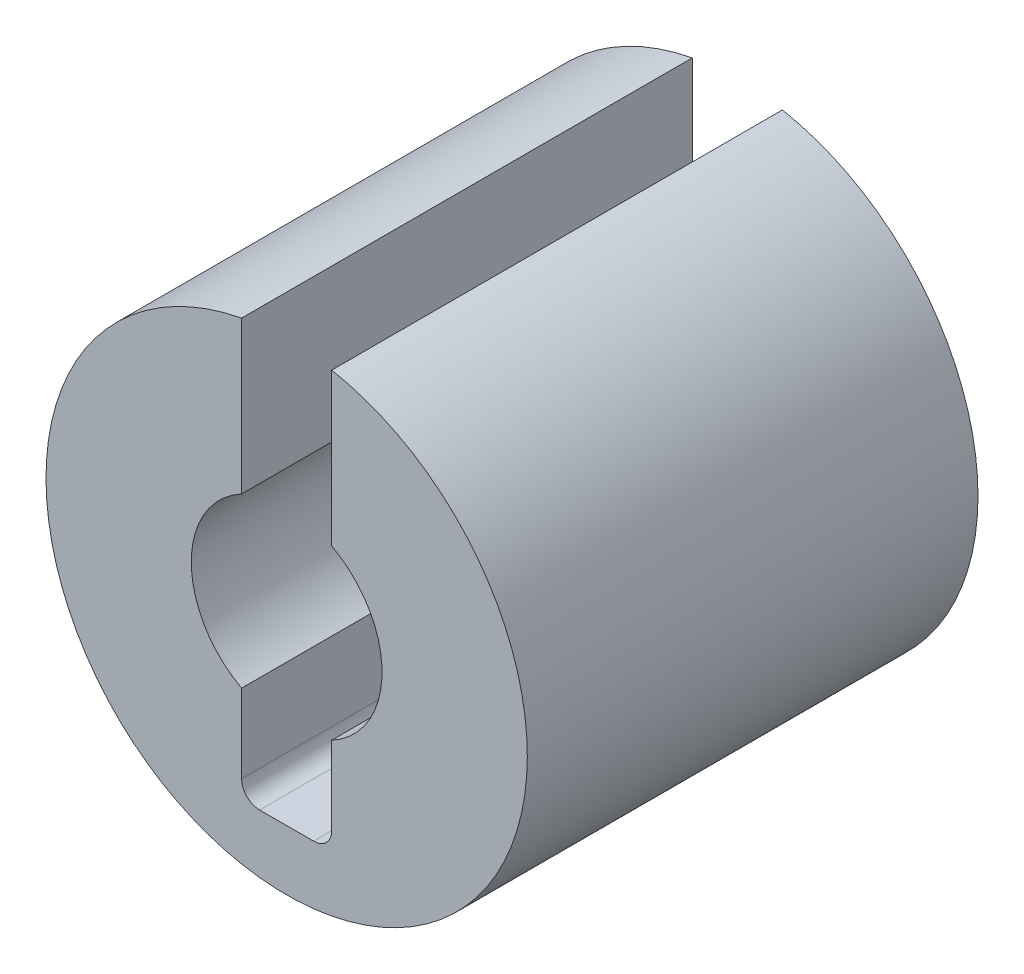
ISO-10303-21;
HEADER;
FILE_DESCRIPTION(('STEP AP214'),'2;1');
FILE_NAME('part.step','',(''),(''),'','','');
FILE_SCHEMA(('AUTOMOTIVE_DESIGN { 1 0 10303 214 1 1 1 1 }'));
ENDSEC;
DATA;
#1=APPLICATION_CONTEXT('core data for automotive mechanical design processes');
#2=APPLICATION_PROTOCOL_DEFINITION('international standard','automotive_design',2000,#1);
#3=PRODUCT_CONTEXT('',#1,'mechanical');
#4=PRODUCT('Part','Part','',(#3));
#5=PRODUCT_RELATED_PRODUCT_CATEGORY('part','',(#4));
#6=PRODUCT_DEFINITION_FORMATION('','',#4);
#7=PRODUCT_DEFINITION_CONTEXT('part definition',#1,'design');
#8=PRODUCT_DEFINITION('design','',#6,#7);
#9=PRODUCT_DEFINITION_SHAPE('','',#8);
#10=(LENGTH_UNIT() NAMED_UNIT(*) SI_UNIT(.MILLI.,.METRE.));
#11=(NAMED_UNIT(*) PLANE_ANGLE_UNIT() SI_UNIT($,.RADIAN.));
#12=(NAMED_UNIT(*) SI_UNIT($,.STERADIAN.) SOLID_ANGLE_UNIT());
#13=UNCERTAINTY_MEASURE_WITH_UNIT(LENGTH_MEASURE(1.E-05),#10,'distance_accuracy_value','');
#14=(GEOMETRIC_REPRESENTATION_CONTEXT(3) GLOBAL_UNCERTAINTY_ASSIGNED_CONTEXT((#13)) GLOBAL_UNIT_ASSIGNED_CONTEXT((#10,
#11,#12)) REPRESENTATION_CONTEXT('',''));
#15=CARTESIAN_POINT('',(0.,0.,0.));
#16=DIRECTION('',(0.,0.,1.));
#17=DIRECTION('',(1.,0.,0.));
#18=AXIS2_PLACEMENT_3D('',#15,#16,#17);
#19=CARTESIAN_POINT('',(-0.75,-3.005,7.5));
#20=DIRECTION('',(0.,-1.,0.));
#21=DIRECTION('',(0.,0.,-1.));
#22=AXIS2_PLACEMENT_3D('',#19,#20,#21);
#23=PLANE('',#22);
#24=DIRECTION('',(0.,0.,1.));
#25=VECTOR('',#24,1.);
#26=CARTESIAN_POINT('',(-0.45,-3.005,7.5));
#27=LINE('',#26,#25);
#28=CARTESIAN_POINT('',(-0.45,-3.005,0.));
#29=VERTEX_POINT('',#28);
#30=CARTESIAN_POINT('',(-0.45,-3.005,7.5));
#31=VERTEX_POINT('',#30);
#32=EDGE_CURVE('E110',#29,#31,#27,.T.);
#33=ORIENTED_EDGE('',*,*,#32,.T.);
#34=DIRECTION('',(1.,0.,0.));
#35=VECTOR('',#34,1.);
#36=CARTESIAN_POINT('',(-0.75,-3.005,7.5));
#37=LINE('',#36,#35);
#38=CARTESIAN_POINT('',(0.45,-3.005,7.5));
#39=VERTEX_POINT('',#38);
#40=EDGE_CURVE('E126',#39,#31,#37,.F.);
#41=ORIENTED_EDGE('',*,*,#40,.F.);
#42=DIRECTION('',(0.,0.,1.));
#43=VECTOR('',#42,1.);
#44=CARTESIAN_POINT('',(0.45,-3.005,7.5));
#45=LINE('',#44,#43);
#46=CARTESIAN_POINT('',(0.45,-3.005,0.));
#47=VERTEX_POINT('',#46);
#48=EDGE_CURVE('E121',#39,#47,#45,.F.);
#49=ORIENTED_EDGE('',*,*,#48,.T.);
#50=DIRECTION('',(1.,0.,0.));
#51=VECTOR('',#50,1.);
#52=CARTESIAN_POINT('',(-0.75,-3.005,0.));
#53=LINE('',#52,#51);
#54=EDGE_CURVE('E111',#29,#47,#53,.T.);
#55=ORIENTED_EDGE('',*,*,#54,.F.);
#56=EDGE_LOOP('',(#33,#41,#49,#55));
#57=FACE_BOUND('',#56,.T.);
#58=ADVANCED_FACE('F17',(#57),#23,.F.);
#59=CARTESIAN_POINT('',(-0.45,-2.705,7.5));
#60=DIRECTION('',(0.,0.,1.));
#61=DIRECTION('',(1.,0.,0.));
#62=AXIS2_PLACEMENT_3D('',#59,#60,#61);
#63=CYLINDRICAL_SURFACE('',#62,0.3);
#64=ORIENTED_EDGE('',*,*,#32,.F.);
#65=CARTESIAN_POINT('',(-0.45,-2.705,0.));
#66=DIRECTION('',(0.,0.,1.));
#67=DIRECTION('',(1.,0.,0.));
#68=AXIS2_PLACEMENT_3D('',#65,#66,#67);
#69=CIRCLE('',#68,0.3);
#70=CARTESIAN_POINT('',(-0.75,-2.705,0.));
#71=VERTEX_POINT('',#70);
#72=EDGE_CURVE('E20',#71,#29,#69,.T.);
#73=ORIENTED_EDGE('',*,*,#72,.F.);
#74=DIRECTION('',(0.,0.,1.));
#75=VECTOR('',#74,1.);
#76=CARTESIAN_POINT('',(-0.75,-2.705,7.5));
#77=LINE('',#76,#75);
#78=CARTESIAN_POINT('',(-0.75,-2.705,7.5));
#79=VERTEX_POINT('',#78);
#80=EDGE_CURVE('E100',#71,#79,#77,.T.);
#81=ORIENTED_EDGE('',*,*,#80,.T.);
#82=CARTESIAN_POINT('',(-0.45,-2.705,7.5));
#83=DIRECTION('',(0.,0.,1.));
#84=DIRECTION('',(1.,0.,0.));
#85=AXIS2_PLACEMENT_3D('',#82,#83,#84);
#86=CIRCLE('',#85,0.3);
#87=EDGE_CURVE('E125',#31,#79,#86,.F.);
#88=ORIENTED_EDGE('',*,*,#87,.F.);
#89=EDGE_LOOP('',(#64,#73,#81,#88));
#90=FACE_BOUND('',#89,.T.);
#91=ADVANCED_FACE('F106',(#90),#63,.F.);
#92=CARTESIAN_POINT('',(0.45,-2.705,7.5));
#93=DIRECTION('',(0.,0.,1.));
#94=DIRECTION('',(1.,0.,0.));
#95=AXIS2_PLACEMENT_3D('',#92,#93,#94);
#96=CYLINDRICAL_SURFACE('',#95,0.3);
#97=DIRECTION('',(0.,0.,-1.));
#98=VECTOR('',#97,1.);
#99=CARTESIAN_POINT('',(0.75,-2.705,7.5));
#100=LINE('',#99,#98);
#101=CARTESIAN_POINT('',(0.75,-2.705,7.5));
#102=VERTEX_POINT('',#101);
#103=CARTESIAN_POINT('',(0.75,-2.705,0.));
#104=VERTEX_POINT('',#103);
#105=EDGE_CURVE('E120',#102,#104,#100,.T.);
#106=ORIENTED_EDGE('',*,*,#105,.T.);
#107=CARTESIAN_POINT('',(0.45,-2.705,0.));
#108=DIRECTION('',(0.,0.,1.));
#109=DIRECTION('',(1.,0.,0.));
#110=AXIS2_PLACEMENT_3D('',#107,#108,#109);
#111=CIRCLE('',#110,0.3);
#112=EDGE_CURVE('E124',#47,#104,#111,.T.);
#113=ORIENTED_EDGE('',*,*,#112,.F.);
#114=ORIENTED_EDGE('',*,*,#48,.F.);
#115=CARTESIAN_POINT('',(0.45,-2.705,7.5));
#116=DIRECTION('',(0.,0.,1.));
#117=DIRECTION('',(1.,0.,0.));
#118=AXIS2_PLACEMENT_3D('',#115,#116,#117);
#119=CIRCLE('',#118,0.3);
#120=EDGE_CURVE('E101',#102,#39,#119,.F.);
#121=ORIENTED_EDGE('',*,*,#120,.F.);
#122=EDGE_LOOP('',(#106,#113,#114,#121));
#123=FACE_BOUND('',#122,.T.);
#124=ADVANCED_FACE('F160',(#123),#96,.F.);
#125=CARTESIAN_POINT('',(-0.75,-3.005,7.5));
#126=DIRECTION('',(-1.,0.,0.));
#127=DIRECTION('',(0.,0.,1.));
#128=AXIS2_PLACEMENT_3D('',#125,#126,#127);
#129=PLANE('',#128);
#130=ORIENTED_EDGE('',*,*,#80,.F.);
#131=DIRECTION('',(0.,1.,0.));
#132=VECTOR('',#131,1.);
#133=CARTESIAN_POINT('',(-0.75,-3.005,0.));
#134=LINE('',#133,#132);
#135=CARTESIAN_POINT('',(-0.75,-1.3991626960436,0.));
#136=VERTEX_POINT('',#135);
#137=EDGE_CURVE('E90',#136,#71,#134,.F.);
#138=ORIENTED_EDGE('',*,*,#137,.F.);
#139=DIRECTION('',(0.,0.,-1.));
#140=VECTOR('',#139,1.);
#141=CARTESIAN_POINT('',(-0.75,-1.3991626960436,7.5));
#142=LINE('',#141,#140);
#143=CARTESIAN_POINT('',(-0.75,-1.3991626960436,7.5));
#144=VERTEX_POINT('',#143);
#145=EDGE_CURVE('E165',#136,#144,#142,.F.);
#146=ORIENTED_EDGE('',*,*,#145,.T.);
#147=DIRECTION('',(0.,1.,0.));
#148=VECTOR('',#147,1.);
#149=CARTESIAN_POINT('',(-0.75,-3.005,7.5));
#150=LINE('',#149,#148);
#151=EDGE_CURVE('E114',#79,#144,#150,.T.);
#152=ORIENTED_EDGE('',*,*,#151,.F.);
#153=EDGE_LOOP('',(#130,#138,#146,#152));
#154=FACE_BOUND('',#153,.T.);
#155=ADVANCED_FACE('F112',(#154),#129,.F.);
#156=CARTESIAN_POINT('',(0.75,-3.005,7.5));
#157=DIRECTION('',(1.,0.,0.));
#158=DIRECTION('',(0.,0.,-1.));
#159=AXIS2_PLACEMENT_3D('',#156,#157,#158);
#160=PLANE('',#159);
#161=ORIENTED_EDGE('',*,*,#105,.F.);
#162=DIRECTION('',(0.,1.,0.));
#163=VECTOR('',#162,1.);
#164=CARTESIAN_POINT('',(0.75,-3.005,7.5));
#165=LINE('',#164,#163);
#166=CARTESIAN_POINT('',(0.75,-1.3991626960436,7.5));
#167=VERTEX_POINT('',#166);
#168=EDGE_CURVE('E116',#167,#102,#165,.F.);
#169=ORIENTED_EDGE('',*,*,#168,.F.);
#170=DIRECTION('',(0.,0.,-1.));
#171=VECTOR('',#170,1.);
#172=CARTESIAN_POINT('',(0.750000000000001,-1.3991626960436,7.5));
#173=LINE('',#172,#171);
#174=CARTESIAN_POINT('',(0.75,-1.3991626960436,0.));
#175=VERTEX_POINT('',#174);
#176=EDGE_CURVE('E164',#167,#175,#173,.T.);
#177=ORIENTED_EDGE('',*,*,#176,.T.);
#178=DIRECTION('',(0.,1.,0.));
#179=VECTOR('',#178,1.);
#180=CARTESIAN_POINT('',(0.75,-3.005,0.));
#181=LINE('',#180,#179);
#182=EDGE_CURVE('E156',#104,#175,#181,.T.);
#183=ORIENTED_EDGE('',*,*,#182,.F.);
#184=EDGE_LOOP('',(#161,#169,#177,#183));
#185=FACE_BOUND('',#184,.T.);
#186=ADVANCED_FACE('F162',(#185),#160,.F.);
#187=CARTESIAN_POINT('',(0.,0.,7.5));
#188=DIRECTION('',(0.,0.,-1.));
#189=DIRECTION('',(-1.,0.,0.));
#190=AXIS2_PLACEMENT_3D('',#187,#188,#189);
#191=CYLINDRICAL_SURFACE('',#190,1.5875);
#192=CARTESIAN_POINT('',(0.,0.,7.5));
#193=DIRECTION('',(0.,0.,-1.));
#194=DIRECTION('',(-1.,0.,0.));
#195=AXIS2_PLACEMENT_3D('',#192,#193,#194);
#196=CIRCLE('',#195,1.5875);
#197=CARTESIAN_POINT('',(-0.75,1.3991626960436,7.5));
#198=VERTEX_POINT('',#197);
#199=EDGE_CURVE('E137',#144,#198,#196,.T.);
#200=ORIENTED_EDGE('',*,*,#199,.F.);
#201=ORIENTED_EDGE('',*,*,#145,.F.);
#202=CARTESIAN_POINT('',(0.,0.,0.));
#203=DIRECTION('',(0.,0.,-1.));
#204=DIRECTION('',(-1.,0.,0.));
#205=AXIS2_PLACEMENT_3D('',#202,#203,#204);
#206=CIRCLE('',#205,1.5875);
#207=CARTESIAN_POINT('',(-0.75,1.3991626960436,0.));
#208=VERTEX_POINT('',#207);
#209=EDGE_CURVE('E95',#136,#208,#206,.T.);
#210=ORIENTED_EDGE('',*,*,#209,.T.);
#211=DIRECTION('',(0.,0.,1.));
#212=VECTOR('',#211,1.);
#213=CARTESIAN_POINT('',(-0.75,1.3991626960436,7.5));
#214=LINE('',#213,#212);
#215=EDGE_CURVE('E167',#208,#198,#214,.T.);
#216=ORIENTED_EDGE('',*,*,#215,.T.);
#217=EDGE_LOOP('',(#200,#201,#210,#216));
#218=FACE_BOUND('',#217,.T.);
#219=ADVANCED_FACE('F195',(#218),#191,.F.);
#220=CARTESIAN_POINT('',(-0.75,1.3991626960436,7.5));
#221=DIRECTION('',(-1.,0.,0.));
#222=DIRECTION('',(0.,-1.,0.));
#223=AXIS2_PLACEMENT_3D('',#220,#221,#222);
#224=PLANE('',#223);
#225=DIRECTION('',(0.,0.,-1.));
#226=VECTOR('',#225,1.);
#227=CARTESIAN_POINT('',(-0.75,3.9341485737069,7.5));
#228=LINE('',#227,#226);
#229=CARTESIAN_POINT('',(-0.75,3.9341485737069,7.5));
#230=VERTEX_POINT('',#229);
#231=CARTESIAN_POINT('',(-0.75,3.9341485737069,0.));
#232=VERTEX_POINT('',#231);
#233=EDGE_CURVE('E136',#230,#232,#228,.T.);
#234=ORIENTED_EDGE('',*,*,#233,.F.);
#235=DIRECTION('',(0.,1.,0.));
#236=VECTOR('',#235,1.);
#237=CARTESIAN_POINT('',(-0.75,0.,7.5));
#238=LINE('',#237,#236);
#239=EDGE_CURVE('E140',#198,#230,#238,.T.);
#240=ORIENTED_EDGE('',*,*,#239,.F.);
#241=ORIENTED_EDGE('',*,*,#215,.F.);
#242=DIRECTION('',(0.,1.,0.));
#243=VECTOR('',#242,1.);
#244=CARTESIAN_POINT('',(-0.75,0.,0.));
#245=LINE('',#244,#243);
#246=EDGE_CURVE('E135',#208,#232,#245,.T.);
#247=ORIENTED_EDGE('',*,*,#246,.T.);
#248=EDGE_LOOP('',(#234,#240,#241,#247));
#249=FACE_BOUND('',#248,.T.);
#250=ADVANCED_FACE('F189',(#249),#224,.F.);
#251=CARTESIAN_POINT('',(0.75,1.3991626960436,7.5));
#252=DIRECTION('',(1.,0.,0.));
#253=DIRECTION('',(0.,1.,0.));
#254=AXIS2_PLACEMENT_3D('',#251,#252,#253);
#255=PLANE('',#254);
#256=DIRECTION('',(0.,0.,-1.));
#257=VECTOR('',#256,1.);
#258=CARTESIAN_POINT('',(0.75,1.3991626960436,7.5));
#259=LINE('',#258,#257);
#260=CARTESIAN_POINT('',(0.75,1.3991626960436,0.));
#261=VERTEX_POINT('',#260);
#262=CARTESIAN_POINT('',(0.75,1.3991626960436,7.5));
#263=VERTEX_POINT('',#262);
#264=EDGE_CURVE('E172',#261,#263,#259,.F.);
#265=ORIENTED_EDGE('',*,*,#264,.T.);
#266=DIRECTION('',(0.,1.,0.));
#267=VECTOR('',#266,1.);
#268=CARTESIAN_POINT('',(0.75,0.,7.5));
#269=LINE('',#268,#267);
#270=CARTESIAN_POINT('',(0.75,3.9341485737069,7.5));
#271=VERTEX_POINT('',#270);
#272=EDGE_CURVE('E175',#271,#263,#269,.F.);
#273=ORIENTED_EDGE('',*,*,#272,.F.);
#274=DIRECTION('',(0.,0.,-1.));
#275=VECTOR('',#274,1.);
#276=CARTESIAN_POINT('',(0.75,3.9341485737069,7.5));
#277=LINE('',#276,#275);
#278=CARTESIAN_POINT('',(0.75,3.9341485737069,0.));
#279=VERTEX_POINT('',#278);
#280=EDGE_CURVE('E144',#279,#271,#277,.F.);
#281=ORIENTED_EDGE('',*,*,#280,.F.);
#282=DIRECTION('',(0.,1.,0.));
#283=VECTOR('',#282,1.);
#284=CARTESIAN_POINT('',(0.75,0.,0.));
#285=LINE('',#284,#283);
#286=EDGE_CURVE('E35',#279,#261,#285,.F.);
#287=ORIENTED_EDGE('',*,*,#286,.T.);
#288=EDGE_LOOP('',(#265,#273,#281,#287));
#289=FACE_BOUND('',#288,.T.);
#290=ADVANCED_FACE('F203',(#289),#255,.F.);
#291=CARTESIAN_POINT('',(0.,0.,7.5));
#292=DIRECTION('',(0.,0.,-1.));
#293=DIRECTION('',(-1.,0.,0.));
#294=AXIS2_PLACEMENT_3D('',#291,#292,#293);
#295=CYLINDRICAL_SURFACE('',#294,1.5875);
#296=ORIENTED_EDGE('',*,*,#176,.F.);
#297=CARTESIAN_POINT('',(0.,0.,7.5));
#298=DIRECTION('',(0.,0.,-1.));
#299=DIRECTION('',(-1.,0.,0.));
#300=AXIS2_PLACEMENT_3D('',#297,#298,#299);
#301=CIRCLE('',#300,1.5875);
#302=EDGE_CURVE('E141',#263,#167,#301,.T.);
#303=ORIENTED_EDGE('',*,*,#302,.F.);
#304=ORIENTED_EDGE('',*,*,#264,.F.);
#305=CARTESIAN_POINT('',(0.,0.,0.));
#306=DIRECTION('',(0.,0.,-1.));
#307=DIRECTION('',(-1.,0.,0.));
#308=AXIS2_PLACEMENT_3D('',#305,#306,#307);
#309=CIRCLE('',#308,1.5875);
#310=EDGE_CURVE('E131',#261,#175,#309,.T.);
#311=ORIENTED_EDGE('',*,*,#310,.T.);
#312=EDGE_LOOP('',(#296,#303,#304,#311));
#313=FACE_BOUND('',#312,.T.);
#314=ADVANCED_FACE('F215',(#313),#295,.F.);
#315=CARTESIAN_POINT('',(0.,0.,7.5));
#316=DIRECTION('',(0.,0.,1.));
#317=DIRECTION('',(1.,0.,0.));
#318=AXIS2_PLACEMENT_3D('',#315,#316,#317);
#319=PLANE('',#318);
#320=CARTESIAN_POINT('',(0.,0.,7.5));
#321=DIRECTION('',(0.,0.,-1.));
#322=DIRECTION('',(-1.,0.,0.));
#323=AXIS2_PLACEMENT_3D('',#320,#321,#322);
#324=CIRCLE('',#323,4.005);
#325=EDGE_CURVE('E26',#271,#230,#324,.T.);
#326=ORIENTED_EDGE('',*,*,#325,.F.);
#327=ORIENTED_EDGE('',*,*,#272,.T.);
#328=ORIENTED_EDGE('',*,*,#302,.T.);
#329=ORIENTED_EDGE('',*,*,#168,.T.);
#330=ORIENTED_EDGE('',*,*,#120,.T.);
#331=ORIENTED_EDGE('',*,*,#40,.T.);
#332=ORIENTED_EDGE('',*,*,#87,.T.);
#333=ORIENTED_EDGE('',*,*,#151,.T.);
#334=ORIENTED_EDGE('',*,*,#199,.T.);
#335=ORIENTED_EDGE('',*,*,#239,.T.);
#336=EDGE_LOOP('',(#326,#327,#328,#329,#330,#331,#332,#333,#334,#335));
#337=FACE_BOUND('',#336,.T.);
#338=ADVANCED_FACE('F148',(#337),#319,.T.);
#339=CARTESIAN_POINT('',(0.,0.,0.));
#340=DIRECTION('',(0.,0.,1.));
#341=DIRECTION('',(1.,0.,0.));
#342=AXIS2_PLACEMENT_3D('',#339,#340,#341);
#343=PLANE('',#342);
#344=ORIENTED_EDGE('',*,*,#286,.F.);
#345=CARTESIAN_POINT('',(0.,0.,0.));
#346=DIRECTION('',(0.,0.,-1.));
#347=DIRECTION('',(-1.,0.,0.));
#348=AXIS2_PLACEMENT_3D('',#345,#346,#347);
#349=CIRCLE('',#348,4.005);
#350=EDGE_CURVE('E11',#232,#279,#349,.F.);
#351=ORIENTED_EDGE('',*,*,#350,.F.);
#352=ORIENTED_EDGE('',*,*,#246,.F.);
#353=ORIENTED_EDGE('',*,*,#209,.F.);
#354=ORIENTED_EDGE('',*,*,#137,.T.);
#355=ORIENTED_EDGE('',*,*,#72,.T.);
#356=ORIENTED_EDGE('',*,*,#54,.T.);
#357=ORIENTED_EDGE('',*,*,#112,.T.);
#358=ORIENTED_EDGE('',*,*,#182,.T.);
#359=ORIENTED_EDGE('',*,*,#310,.F.);
#360=EDGE_LOOP('',(#344,#351,#352,#353,#354,#355,#356,#357,#358,#359));
#361=FACE_BOUND('',#360,.T.);
#362=ADVANCED_FACE('F92',(#361),#343,.F.);
#363=CARTESIAN_POINT('',(0.,0.,7.5));
#364=DIRECTION('',(0.,0.,-1.));
#365=DIRECTION('',(-1.,0.,0.));
#366=AXIS2_PLACEMENT_3D('',#363,#364,#365);
#367=CYLINDRICAL_SURFACE('',#366,4.005);
#368=ORIENTED_EDGE('',*,*,#325,.T.);
#369=ORIENTED_EDGE('',*,*,#233,.T.);
#370=ORIENTED_EDGE('',*,*,#350,.T.);
#371=ORIENTED_EDGE('',*,*,#280,.T.);
#372=EDGE_LOOP('',(#368,#369,#370,#371));
#373=FACE_BOUND('',#372,.T.);
#374=ADVANCED_FACE('F192',(#373),#367,.T.);
#375=CLOSED_SHELL('',(#58,#91,#124,#155,#186,#219,#250,#290,#314,#338,#362,#374));
#376=MANIFOLD_SOLID_BREP('B1',#375);
#377=ADVANCED_BREP_SHAPE_REPRESENTATION('',(#18,#376),#14);
#378=SHAPE_DEFINITION_REPRESENTATION(#9,#377);
ENDSEC;
END-ISO-10303-21;
